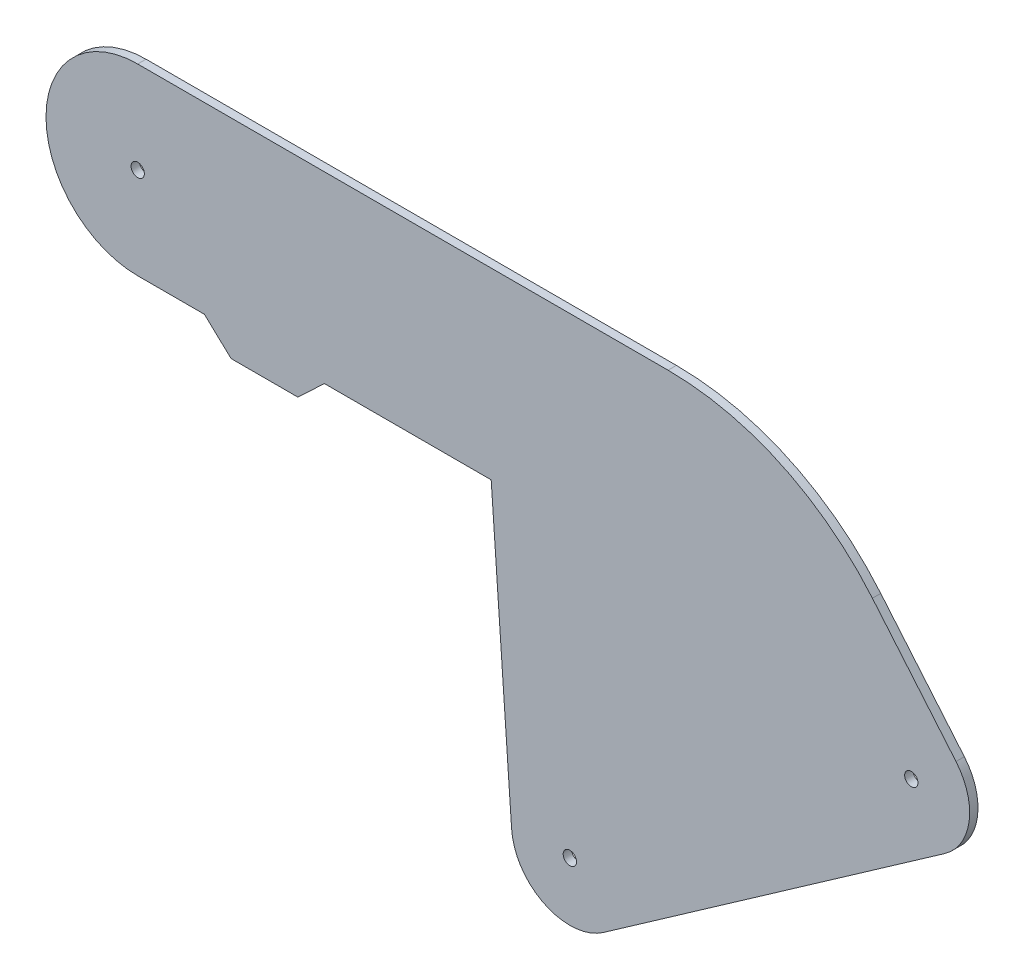
ISO-10303-21;
HEADER;
FILE_DESCRIPTION(('STEP AP214'),'2;1');
FILE_NAME('part.step','',(''),(''),'','','');
FILE_SCHEMA(('AUTOMOTIVE_DESIGN { 1 0 10303 214 1 1 1 1 }'));
ENDSEC;
DATA;
#1=APPLICATION_CONTEXT('core data for automotive mechanical design processes');
#2=APPLICATION_PROTOCOL_DEFINITION('international standard','automotive_design',2000,#1);
#3=PRODUCT_CONTEXT('',#1,'mechanical');
#4=PRODUCT('Part','Part','',(#3));
#5=PRODUCT_RELATED_PRODUCT_CATEGORY('part','',(#4));
#6=PRODUCT_DEFINITION_FORMATION('','',#4);
#7=PRODUCT_DEFINITION_CONTEXT('part definition',#1,'design');
#8=PRODUCT_DEFINITION('design','',#6,#7);
#9=PRODUCT_DEFINITION_SHAPE('','',#8);
#10=(LENGTH_UNIT() NAMED_UNIT(*) SI_UNIT(.MILLI.,.METRE.));
#11=(NAMED_UNIT(*) PLANE_ANGLE_UNIT() SI_UNIT($,.RADIAN.));
#12=(NAMED_UNIT(*) SI_UNIT($,.STERADIAN.) SOLID_ANGLE_UNIT());
#13=UNCERTAINTY_MEASURE_WITH_UNIT(LENGTH_MEASURE(1.E-05),#10,'distance_accuracy_value','');
#14=(GEOMETRIC_REPRESENTATION_CONTEXT(3) GLOBAL_UNCERTAINTY_ASSIGNED_CONTEXT((#13)) GLOBAL_UNIT_ASSIGNED_CONTEXT((#10,
#11,#12)) REPRESENTATION_CONTEXT('',''));
#15=CARTESIAN_POINT('',(0.,0.,0.));
#16=DIRECTION('',(0.,0.,1.));
#17=DIRECTION('',(1.,0.,0.));
#18=AXIS2_PLACEMENT_3D('',#15,#16,#17);
#19=CARTESIAN_POINT('',(164.572072720799,71.2488259804572,3.175));
#20=DIRECTION('',(0.,0.,1.));
#21=DIRECTION('',(1.,0.,0.));
#22=AXIS2_PLACEMENT_3D('',#19,#20,#21);
#23=PLANE('',#22);
#24=CARTESIAN_POINT('',(0.,215.9,3.175));
#25=DIRECTION('',(0.,0.,1.));
#26=DIRECTION('',(1.,0.,0.));
#27=AXIS2_PLACEMENT_3D('',#24,#25,#26);
#28=CIRCLE('',#27,2.54000000000001);
#29=CARTESIAN_POINT('',(2.54000000000001,215.9,3.175));
#30=VERTEX_POINT('',#29);
#31=EDGE_CURVE('E308',#30,#30,#28,.T.);
#32=ORIENTED_EDGE('',*,*,#31,.F.);
#33=EDGE_LOOP('',(#32));
#34=FACE_BOUND('',#33,.T.);
#35=CARTESIAN_POINT('',(164.572072720799,71.2488259804572,3.175));
#36=DIRECTION('',(0.,0.,1.));
#37=DIRECTION('',(1.,0.,0.));
#38=AXIS2_PLACEMENT_3D('',#35,#36,#37);
#39=CIRCLE('',#38,22.2249999999999);
#40=CARTESIAN_POINT('',(142.401211703775,69.6984883514941,3.175));
#41=VERTEX_POINT('',#40);
#42=CARTESIAN_POINT('',(177.319809018701,53.0431717961344,3.175));
#43=VERTEX_POINT('',#42);
#44=EDGE_CURVE('E194',#41,#43,#39,.T.);
#45=ORIENTED_EDGE('',*,*,#44,.T.);
#46=DIRECTION('',(0.819152044288991,0.573576436351047,0.));
#47=VECTOR('',#46,1.);
#48=CARTESIAN_POINT('',(177.319809018701,53.0431717961344,3.175));
#49=LINE('',#48,#47);
#50=CARTESIAN_POINT('',(307.360196049579,144.098431066863,3.175));
#51=VERTEX_POINT('',#50);
#52=EDGE_CURVE('E117',#43,#51,#49,.T.);
#53=ORIENTED_EDGE('',*,*,#52,.T.);
#54=CARTESIAN_POINT('',(294.612459751677,162.304085251186,3.175));
#55=DIRECTION('',(0.,0.,1.));
#56=DIRECTION('',(-1.,0.,0.));
#57=AXIS2_PLACEMENT_3D('',#54,#55,#56);
#58=CIRCLE('',#57,22.225);
#59=CARTESIAN_POINT('',(311.637797499996,176.590039876469,3.175));
#60=VERTEX_POINT('',#59);
#61=EDGE_CURVE('E224',#51,#60,#58,.T.);
#62=ORIENTED_EDGE('',*,*,#61,.T.);
#63=DIRECTION('',(-0.642787609686537,0.76604444311898,0.));
#64=VECTOR('',#63,1.);
#65=CARTESIAN_POINT('',(279.800527192222,214.532221144152,3.175));
#66=LINE('',#65,#64);
#67=CARTESIAN_POINT('',(279.800527192222,214.532221144152,3.175));
#68=VERTEX_POINT('',#67);
#69=EDGE_CURVE('E243',#60,#68,#66,.T.);
#70=ORIENTED_EDGE('',*,*,#69,.T.);
#71=CARTESIAN_POINT('',(201.970411771333,149.225,3.175));
#72=DIRECTION('',(0.,0.,1.));
#73=DIRECTION('',(-1.,0.,0.));
#74=AXIS2_PLACEMENT_3D('',#71,#72,#73);
#75=CIRCLE('',#74,101.6);
#76=CARTESIAN_POINT('',(201.970411771333,250.825,3.175));
#77=VERTEX_POINT('',#76);
#78=EDGE_CURVE('E240',#68,#77,#75,.T.);
#79=ORIENTED_EDGE('',*,*,#78,.T.);
#80=DIRECTION('',(-1.,0.,0.));
#81=VECTOR('',#80,1.);
#82=CARTESIAN_POINT('',(0.,250.825,3.175));
#83=LINE('',#82,#81);
#84=CARTESIAN_POINT('',(0.,250.825,3.175));
#85=VERTEX_POINT('',#84);
#86=EDGE_CURVE('E242',#77,#85,#83,.T.);
#87=ORIENTED_EDGE('',*,*,#86,.T.);
#88=CARTESIAN_POINT('',(0.,215.9,3.175));
#89=DIRECTION('',(0.,0.,1.));
#90=DIRECTION('',(1.,0.,0.));
#91=AXIS2_PLACEMENT_3D('',#88,#89,#90);
#92=CIRCLE('',#91,34.925);
#93=CARTESIAN_POINT('',(0.,180.975,3.175));
#94=VERTEX_POINT('',#93);
#95=EDGE_CURVE('E245',#85,#94,#92,.T.);
#96=ORIENTED_EDGE('',*,*,#95,.T.);
#97=DIRECTION('',(1.,0.,0.));
#98=VECTOR('',#97,1.);
#99=CARTESIAN_POINT('',(0.,180.975,3.175));
#100=LINE('',#99,#98);
#101=CARTESIAN_POINT('',(25.4,180.975,3.175));
#102=VERTEX_POINT('',#101);
#103=EDGE_CURVE('E251',#94,#102,#100,.T.);
#104=ORIENTED_EDGE('',*,*,#103,.T.);
#105=DIRECTION('',(0.729537204140084,-0.683941128881331,0.));
#106=VECTOR('',#105,1.);
#107=CARTESIAN_POINT('',(25.4,180.975,3.175));
#108=LINE('',#107,#106);
#109=CARTESIAN_POINT('',(35.56,171.45,3.175));
#110=VERTEX_POINT('',#109);
#111=EDGE_CURVE('E253',#102,#110,#108,.T.);
#112=ORIENTED_EDGE('',*,*,#111,.T.);
#113=DIRECTION('',(1.,0.,0.));
#114=VECTOR('',#113,1.);
#115=CARTESIAN_POINT('',(35.56,171.45,3.175));
#116=LINE('',#115,#114);
#117=CARTESIAN_POINT('',(60.96,171.45,3.175));
#118=VERTEX_POINT('',#117);
#119=EDGE_CURVE('E151',#110,#118,#116,.T.);
#120=ORIENTED_EDGE('',*,*,#119,.T.);
#121=DIRECTION('',(0.729537204140085,0.68394112888133,0.));
#122=VECTOR('',#121,1.);
#123=CARTESIAN_POINT('',(60.96,171.45,3.175));
#124=LINE('',#123,#122);
#125=CARTESIAN_POINT('',(71.12,180.975,3.175));
#126=VERTEX_POINT('',#125);
#127=EDGE_CURVE('E145',#118,#126,#124,.T.);
#128=ORIENTED_EDGE('',*,*,#127,.T.);
#129=DIRECTION('',(1.,0.,0.));
#130=VECTOR('',#129,1.);
#131=CARTESIAN_POINT('',(71.12,180.975,3.175));
#132=LINE('',#131,#130);
#133=CARTESIAN_POINT('',(134.62,180.975,3.175));
#134=VERTEX_POINT('',#133);
#135=EDGE_CURVE('E149',#126,#134,#132,.T.);
#136=ORIENTED_EDGE('',*,*,#135,.T.);
#137=DIRECTION('',(0.069756473744122,-0.997564050259824,0.));
#138=VECTOR('',#137,1.);
#139=CARTESIAN_POINT('',(134.62,180.975,3.175));
#140=LINE('',#139,#138);
#141=EDGE_CURVE('E59',#134,#41,#140,.T.);
#142=ORIENTED_EDGE('',*,*,#141,.T.);
#143=EDGE_LOOP('',(#45,#53,#62,#70,#79,#87,#96,#104,#112,#120,#128,#136,#142));
#144=FACE_BOUND('',#143,.T.);
#145=CARTESIAN_POINT('',(164.572072720799,71.2488259804572,3.175));
#146=DIRECTION('',(0.,0.,1.));
#147=DIRECTION('',(1.,0.,0.));
#148=AXIS2_PLACEMENT_3D('',#145,#146,#147);
#149=CIRCLE('',#148,2.5400000000398);
#150=CARTESIAN_POINT('',(167.112072720839,71.2488259804572,3.175));
#151=VERTEX_POINT('',#150);
#152=EDGE_CURVE('E173',#151,#151,#149,.T.);
#153=ORIENTED_EDGE('',*,*,#152,.F.);
#154=EDGE_LOOP('',(#153));
#155=FACE_BOUND('',#154,.T.);
#156=CARTESIAN_POINT('',(294.612459751677,162.304085251186,3.175));
#157=DIRECTION('',(0.,0.,1.));
#158=DIRECTION('',(1.,0.,0.));
#159=AXIS2_PLACEMENT_3D('',#156,#157,#158);
#160=CIRCLE('',#159,2.54000000000186);
#161=CARTESIAN_POINT('',(297.152459751678,162.304085251186,3.175));
#162=VERTEX_POINT('',#161);
#163=EDGE_CURVE('E299',#162,#162,#160,.T.);
#164=ORIENTED_EDGE('',*,*,#163,.F.);
#165=EDGE_LOOP('',(#164));
#166=FACE_BOUND('',#165,.T.);
#167=ADVANCED_FACE('F42',(#34,#144,#155,#166),#23,.T.);
#168=CARTESIAN_POINT('',(164.572072720799,71.2488259804572,0.));
#169=DIRECTION('',(0.,0.,1.));
#170=DIRECTION('',(1.,0.,0.));
#171=AXIS2_PLACEMENT_3D('',#168,#169,#170);
#172=PLANE('',#171);
#173=CARTESIAN_POINT('',(164.572072720799,71.2488259804572,0.));
#174=DIRECTION('',(0.,0.,1.));
#175=DIRECTION('',(1.,0.,0.));
#176=AXIS2_PLACEMENT_3D('',#173,#174,#175);
#177=CIRCLE('',#176,22.2249999999999);
#178=CARTESIAN_POINT('',(142.401211703775,69.6984883514941,0.));
#179=VERTEX_POINT('',#178);
#180=CARTESIAN_POINT('',(177.319809018701,53.0431717961344,0.));
#181=VERTEX_POINT('',#180);
#182=EDGE_CURVE('E169',#179,#181,#177,.T.);
#183=ORIENTED_EDGE('',*,*,#182,.F.);
#184=DIRECTION('',(0.069756473744122,-0.997564050259824,0.));
#185=VECTOR('',#184,1.);
#186=CARTESIAN_POINT('',(134.62,180.975,0.));
#187=LINE('',#186,#185);
#188=CARTESIAN_POINT('',(134.62,180.975,0.));
#189=VERTEX_POINT('',#188);
#190=EDGE_CURVE('E109',#189,#179,#187,.T.);
#191=ORIENTED_EDGE('',*,*,#190,.F.);
#192=DIRECTION('',(1.,0.,0.));
#193=VECTOR('',#192,1.);
#194=CARTESIAN_POINT('',(71.12,180.975,0.));
#195=LINE('',#194,#193);
#196=CARTESIAN_POINT('',(71.12,180.975,0.));
#197=VERTEX_POINT('',#196);
#198=EDGE_CURVE('E103',#197,#189,#195,.T.);
#199=ORIENTED_EDGE('',*,*,#198,.F.);
#200=DIRECTION('',(0.729537204140085,0.68394112888133,0.));
#201=VECTOR('',#200,1.);
#202=CARTESIAN_POINT('',(60.96,171.45,0.));
#203=LINE('',#202,#201);
#204=CARTESIAN_POINT('',(60.96,171.45,0.));
#205=VERTEX_POINT('',#204);
#206=EDGE_CURVE('E159',#205,#197,#203,.T.);
#207=ORIENTED_EDGE('',*,*,#206,.F.);
#208=DIRECTION('',(1.,0.,0.));
#209=VECTOR('',#208,1.);
#210=CARTESIAN_POINT('',(35.56,171.45,0.));
#211=LINE('',#210,#209);
#212=CARTESIAN_POINT('',(35.56,171.45,0.));
#213=VERTEX_POINT('',#212);
#214=EDGE_CURVE('E189',#213,#205,#211,.T.);
#215=ORIENTED_EDGE('',*,*,#214,.F.);
#216=DIRECTION('',(0.729537204140084,-0.683941128881331,0.));
#217=VECTOR('',#216,1.);
#218=CARTESIAN_POINT('',(25.4,180.975,0.));
#219=LINE('',#218,#217);
#220=CARTESIAN_POINT('',(25.4,180.975,0.));
#221=VERTEX_POINT('',#220);
#222=EDGE_CURVE('E187',#221,#213,#219,.T.);
#223=ORIENTED_EDGE('',*,*,#222,.F.);
#224=DIRECTION('',(1.,0.,0.));
#225=VECTOR('',#224,1.);
#226=CARTESIAN_POINT('',(0.,180.975,0.));
#227=LINE('',#226,#225);
#228=CARTESIAN_POINT('',(0.,180.975,0.));
#229=VERTEX_POINT('',#228);
#230=EDGE_CURVE('E185',#229,#221,#227,.T.);
#231=ORIENTED_EDGE('',*,*,#230,.F.);
#232=CARTESIAN_POINT('',(0.,215.9,0.));
#233=DIRECTION('',(0.,0.,1.));
#234=DIRECTION('',(1.,0.,0.));
#235=AXIS2_PLACEMENT_3D('',#232,#233,#234);
#236=CIRCLE('',#235,34.925);
#237=CARTESIAN_POINT('',(0.,250.825,0.));
#238=VERTEX_POINT('',#237);
#239=EDGE_CURVE('E183',#238,#229,#236,.T.);
#240=ORIENTED_EDGE('',*,*,#239,.F.);
#241=DIRECTION('',(-1.,0.,0.));
#242=VECTOR('',#241,1.);
#243=CARTESIAN_POINT('',(0.,250.825,0.));
#244=LINE('',#243,#242);
#245=CARTESIAN_POINT('',(201.970411771333,250.825,0.));
#246=VERTEX_POINT('',#245);
#247=EDGE_CURVE('E181',#246,#238,#244,.T.);
#248=ORIENTED_EDGE('',*,*,#247,.F.);
#249=CARTESIAN_POINT('',(201.970411771333,149.225,0.));
#250=DIRECTION('',(0.,0.,1.));
#251=DIRECTION('',(-1.,0.,0.));
#252=AXIS2_PLACEMENT_3D('',#249,#250,#251);
#253=CIRCLE('',#252,101.6);
#254=CARTESIAN_POINT('',(279.800527192222,214.532221144152,0.));
#255=VERTEX_POINT('',#254);
#256=EDGE_CURVE('E179',#255,#246,#253,.T.);
#257=ORIENTED_EDGE('',*,*,#256,.F.);
#258=DIRECTION('',(-0.642787609686537,0.76604444311898,0.));
#259=VECTOR('',#258,1.);
#260=CARTESIAN_POINT('',(279.800527192222,214.532221144152,0.));
#261=LINE('',#260,#259);
#262=CARTESIAN_POINT('',(311.637797499996,176.590039876469,0.));
#263=VERTEX_POINT('',#262);
#264=EDGE_CURVE('E177',#263,#255,#261,.T.);
#265=ORIENTED_EDGE('',*,*,#264,.F.);
#266=CARTESIAN_POINT('',(294.612459751677,162.304085251186,0.));
#267=DIRECTION('',(0.,0.,1.));
#268=DIRECTION('',(-1.,0.,0.));
#269=AXIS2_PLACEMENT_3D('',#266,#267,#268);
#270=CIRCLE('',#269,22.225);
#271=CARTESIAN_POINT('',(307.360196049579,144.098431066863,0.));
#272=VERTEX_POINT('',#271);
#273=EDGE_CURVE('E175',#272,#263,#270,.T.);
#274=ORIENTED_EDGE('',*,*,#273,.F.);
#275=DIRECTION('',(0.819152044288991,0.573576436351047,0.));
#276=VECTOR('',#275,1.);
#277=CARTESIAN_POINT('',(177.319809018701,53.0431717961344,0.));
#278=LINE('',#277,#276);
#279=EDGE_CURVE('E172',#181,#272,#278,.T.);
#280=ORIENTED_EDGE('',*,*,#279,.F.);
#281=EDGE_LOOP('',(#183,#191,#199,#207,#215,#223,#231,#240,#248,#257,#265,#274,#280));
#282=FACE_BOUND('',#281,.T.);
#283=CARTESIAN_POINT('',(164.572072720799,71.2488259804572,0.));
#284=DIRECTION('',(0.,0.,1.));
#285=DIRECTION('',(1.,0.,0.));
#286=AXIS2_PLACEMENT_3D('',#283,#284,#285);
#287=CIRCLE('',#286,2.5400000000398);
#288=CARTESIAN_POINT('',(167.112072720839,71.2488259804572,0.));
#289=VERTEX_POINT('',#288);
#290=EDGE_CURVE('E311',#289,#289,#287,.T.);
#291=ORIENTED_EDGE('',*,*,#290,.T.);
#292=EDGE_LOOP('',(#291));
#293=FACE_BOUND('',#292,.T.);
#294=CARTESIAN_POINT('',(0.,215.9,0.));
#295=DIRECTION('',(0.,0.,1.));
#296=DIRECTION('',(1.,0.,0.));
#297=AXIS2_PLACEMENT_3D('',#294,#295,#296);
#298=CIRCLE('',#297,2.54000000000001);
#299=CARTESIAN_POINT('',(2.54000000000001,215.9,0.));
#300=VERTEX_POINT('',#299);
#301=EDGE_CURVE('E305',#300,#300,#298,.T.);
#302=ORIENTED_EDGE('',*,*,#301,.T.);
#303=EDGE_LOOP('',(#302));
#304=FACE_BOUND('',#303,.T.);
#305=CARTESIAN_POINT('',(294.612459751677,162.304085251186,0.));
#306=DIRECTION('',(0.,0.,1.));
#307=DIRECTION('',(1.,0.,0.));
#308=AXIS2_PLACEMENT_3D('',#305,#306,#307);
#309=CIRCLE('',#308,2.54000000000186);
#310=CARTESIAN_POINT('',(297.152459751678,162.304085251186,0.));
#311=VERTEX_POINT('',#310);
#312=EDGE_CURVE('E302',#311,#311,#309,.T.);
#313=ORIENTED_EDGE('',*,*,#312,.T.);
#314=EDGE_LOOP('',(#313));
#315=FACE_BOUND('',#314,.T.);
#316=ADVANCED_FACE('F228',(#282,#293,#304,#315),#172,.F.);
#317=CARTESIAN_POINT('',(164.572072720799,71.2488259804572,3.175));
#318=DIRECTION('',(0.,0.,-1.));
#319=DIRECTION('',(-1.,0.,0.));
#320=AXIS2_PLACEMENT_3D('',#317,#318,#319);
#321=CYLINDRICAL_SURFACE('',#320,22.2249999999999);
#322=ORIENTED_EDGE('',*,*,#182,.T.);
#323=DIRECTION('',(0.,0.,-1.));
#324=VECTOR('',#323,1.);
#325=CARTESIAN_POINT('',(177.319809018701,53.0431717961344,3.175));
#326=LINE('',#325,#324);
#327=EDGE_CURVE('E11',#43,#181,#326,.T.);
#328=ORIENTED_EDGE('',*,*,#327,.F.);
#329=ORIENTED_EDGE('',*,*,#44,.F.);
#330=DIRECTION('',(0.,0.,-1.));
#331=VECTOR('',#330,1.);
#332=CARTESIAN_POINT('',(142.401211703775,69.6984883514941,3.175));
#333=LINE('',#332,#331);
#334=EDGE_CURVE('E165',#41,#179,#333,.T.);
#335=ORIENTED_EDGE('',*,*,#334,.T.);
#336=EDGE_LOOP('',(#322,#328,#329,#335));
#337=FACE_BOUND('',#336,.T.);
#338=ADVANCED_FACE('F44',(#337),#321,.T.);
#339=CARTESIAN_POINT('',(177.319809018701,53.0431717961344,3.175));
#340=DIRECTION('',(-0.573576436351047,0.819152044288991,0.));
#341=DIRECTION('',(-0.819152044288992,-0.573576436351047,0.));
#342=AXIS2_PLACEMENT_3D('',#339,#340,#341);
#343=PLANE('',#342);
#344=ORIENTED_EDGE('',*,*,#279,.T.);
#345=DIRECTION('',(0.,0.,-1.));
#346=VECTOR('',#345,1.);
#347=CARTESIAN_POINT('',(307.360196049579,144.098431066863,3.175));
#348=LINE('',#347,#346);
#349=EDGE_CURVE('E51',#51,#272,#348,.T.);
#350=ORIENTED_EDGE('',*,*,#349,.F.);
#351=ORIENTED_EDGE('',*,*,#52,.F.);
#352=ORIENTED_EDGE('',*,*,#327,.T.);
#353=EDGE_LOOP('',(#344,#350,#351,#352));
#354=FACE_BOUND('',#353,.T.);
#355=ADVANCED_FACE('F426',(#354),#343,.F.);
#356=CARTESIAN_POINT('',(294.612459751677,162.304085251186,3.175));
#357=DIRECTION('',(0.,0.,-1.));
#358=DIRECTION('',(-1.,0.,0.));
#359=AXIS2_PLACEMENT_3D('',#356,#357,#358);
#360=CYLINDRICAL_SURFACE('',#359,22.225);
#361=ORIENTED_EDGE('',*,*,#273,.T.);
#362=DIRECTION('',(0.,0.,-1.));
#363=VECTOR('',#362,1.);
#364=CARTESIAN_POINT('',(311.637797499996,176.590039876469,3.175));
#365=LINE('',#364,#363);
#366=EDGE_CURVE('E216',#60,#263,#365,.T.);
#367=ORIENTED_EDGE('',*,*,#366,.F.);
#368=ORIENTED_EDGE('',*,*,#61,.F.);
#369=ORIENTED_EDGE('',*,*,#349,.T.);
#370=EDGE_LOOP('',(#361,#367,#368,#369));
#371=FACE_BOUND('',#370,.T.);
#372=ADVANCED_FACE('F222',(#371),#360,.T.);
#373=CARTESIAN_POINT('',(279.800527192222,214.532221144152,3.175));
#374=DIRECTION('',(-0.76604444311898,-0.642787609686537,0.));
#375=DIRECTION('',(0.642787609686537,-0.76604444311898,0.));
#376=AXIS2_PLACEMENT_3D('',#373,#374,#375);
#377=PLANE('',#376);
#378=ORIENTED_EDGE('',*,*,#264,.T.);
#379=DIRECTION('',(0.,0.,-1.));
#380=VECTOR('',#379,1.);
#381=CARTESIAN_POINT('',(279.800527192222,214.532221144152,3.175));
#382=LINE('',#381,#380);
#383=EDGE_CURVE('E213',#68,#255,#382,.T.);
#384=ORIENTED_EDGE('',*,*,#383,.F.);
#385=ORIENTED_EDGE('',*,*,#69,.F.);
#386=ORIENTED_EDGE('',*,*,#366,.T.);
#387=EDGE_LOOP('',(#378,#384,#385,#386));
#388=FACE_BOUND('',#387,.T.);
#389=ADVANCED_FACE('F234',(#388),#377,.F.);
#390=CARTESIAN_POINT('',(201.970411771333,149.225,3.175));
#391=DIRECTION('',(0.,0.,-1.));
#392=DIRECTION('',(-1.,0.,0.));
#393=AXIS2_PLACEMENT_3D('',#390,#391,#392);
#394=CYLINDRICAL_SURFACE('',#393,101.6);
#395=ORIENTED_EDGE('',*,*,#256,.T.);
#396=DIRECTION('',(0.,0.,-1.));
#397=VECTOR('',#396,1.);
#398=CARTESIAN_POINT('',(201.970411771333,250.825,3.175));
#399=LINE('',#398,#397);
#400=EDGE_CURVE('E210',#77,#246,#399,.T.);
#401=ORIENTED_EDGE('',*,*,#400,.F.);
#402=ORIENTED_EDGE('',*,*,#78,.F.);
#403=ORIENTED_EDGE('',*,*,#383,.T.);
#404=EDGE_LOOP('',(#395,#401,#402,#403));
#405=FACE_BOUND('',#404,.T.);
#406=ADVANCED_FACE('F238',(#405),#394,.T.);
#407=CARTESIAN_POINT('',(0.,250.825,3.175));
#408=DIRECTION('',(0.,-1.,0.));
#409=DIRECTION('',(1.,0.,0.));
#410=AXIS2_PLACEMENT_3D('',#407,#408,#409);
#411=PLANE('',#410);
#412=ORIENTED_EDGE('',*,*,#247,.T.);
#413=DIRECTION('',(0.,0.,-1.));
#414=VECTOR('',#413,1.);
#415=CARTESIAN_POINT('',(0.,250.825,3.175));
#416=LINE('',#415,#414);
#417=EDGE_CURVE('E207',#85,#238,#416,.T.);
#418=ORIENTED_EDGE('',*,*,#417,.F.);
#419=ORIENTED_EDGE('',*,*,#86,.F.);
#420=ORIENTED_EDGE('',*,*,#400,.T.);
#421=EDGE_LOOP('',(#412,#418,#419,#420));
#422=FACE_BOUND('',#421,.T.);
#423=ADVANCED_FACE('F391',(#422),#411,.F.);
#424=CARTESIAN_POINT('',(0.,215.9,3.175));
#425=DIRECTION('',(0.,0.,-1.));
#426=DIRECTION('',(-1.,0.,0.));
#427=AXIS2_PLACEMENT_3D('',#424,#425,#426);
#428=CYLINDRICAL_SURFACE('',#427,34.925);
#429=ORIENTED_EDGE('',*,*,#239,.T.);
#430=DIRECTION('',(0.,0.,-1.));
#431=VECTOR('',#430,1.);
#432=CARTESIAN_POINT('',(0.,180.975,3.175));
#433=LINE('',#432,#431);
#434=EDGE_CURVE('E204',#94,#229,#433,.T.);
#435=ORIENTED_EDGE('',*,*,#434,.F.);
#436=ORIENTED_EDGE('',*,*,#95,.F.);
#437=ORIENTED_EDGE('',*,*,#417,.T.);
#438=EDGE_LOOP('',(#429,#435,#436,#437));
#439=FACE_BOUND('',#438,.T.);
#440=ADVANCED_FACE('F381',(#439),#428,.T.);
#441=CARTESIAN_POINT('',(0.,180.975,3.175));
#442=DIRECTION('',(0.,1.,0.));
#443=DIRECTION('',(0.,0.,1.));
#444=AXIS2_PLACEMENT_3D('',#441,#442,#443);
#445=PLANE('',#444);
#446=ORIENTED_EDGE('',*,*,#230,.T.);
#447=DIRECTION('',(0.,0.,-1.));
#448=VECTOR('',#447,1.);
#449=CARTESIAN_POINT('',(25.4,180.975,3.175));
#450=LINE('',#449,#448);
#451=EDGE_CURVE('E201',#102,#221,#450,.T.);
#452=ORIENTED_EDGE('',*,*,#451,.F.);
#453=ORIENTED_EDGE('',*,*,#103,.F.);
#454=ORIENTED_EDGE('',*,*,#434,.T.);
#455=EDGE_LOOP('',(#446,#452,#453,#454));
#456=FACE_BOUND('',#455,.T.);
#457=ADVANCED_FACE('F372',(#456),#445,.F.);
#458=CARTESIAN_POINT('',(25.4,180.975,3.175));
#459=DIRECTION('',(0.683941128881331,0.729537204140084,0.));
#460=DIRECTION('',(-0.729537204140084,0.683941128881331,0.));
#461=AXIS2_PLACEMENT_3D('',#458,#459,#460);
#462=PLANE('',#461);
#463=ORIENTED_EDGE('',*,*,#222,.T.);
#464=DIRECTION('',(0.,0.,-1.));
#465=VECTOR('',#464,1.);
#466=CARTESIAN_POINT('',(35.56,171.45,3.175));
#467=LINE('',#466,#465);
#468=EDGE_CURVE('E198',#110,#213,#467,.T.);
#469=ORIENTED_EDGE('',*,*,#468,.F.);
#470=ORIENTED_EDGE('',*,*,#111,.F.);
#471=ORIENTED_EDGE('',*,*,#451,.T.);
#472=EDGE_LOOP('',(#463,#469,#470,#471));
#473=FACE_BOUND('',#472,.T.);
#474=ADVANCED_FACE('F259',(#473),#462,.F.);
#475=CARTESIAN_POINT('',(35.56,171.45,3.175));
#476=DIRECTION('',(0.,1.,0.));
#477=DIRECTION('',(0.,0.,1.));
#478=AXIS2_PLACEMENT_3D('',#475,#476,#477);
#479=PLANE('',#478);
#480=ORIENTED_EDGE('',*,*,#214,.T.);
#481=DIRECTION('',(0.,0.,-1.));
#482=VECTOR('',#481,1.);
#483=CARTESIAN_POINT('',(60.96,171.45,3.175));
#484=LINE('',#483,#482);
#485=EDGE_CURVE('E160',#118,#205,#484,.T.);
#486=ORIENTED_EDGE('',*,*,#485,.F.);
#487=ORIENTED_EDGE('',*,*,#119,.F.);
#488=ORIENTED_EDGE('',*,*,#468,.T.);
#489=EDGE_LOOP('',(#480,#486,#487,#488));
#490=FACE_BOUND('',#489,.T.);
#491=ADVANCED_FACE('F263',(#490),#479,.F.);
#492=CARTESIAN_POINT('',(60.96,171.45,3.175));
#493=DIRECTION('',(-0.68394112888133,0.729537204140085,0.));
#494=DIRECTION('',(-0.729537204140085,-0.68394112888133,0.));
#495=AXIS2_PLACEMENT_3D('',#492,#493,#494);
#496=PLANE('',#495);
#497=ORIENTED_EDGE('',*,*,#206,.T.);
#498=DIRECTION('',(0.,0.,-1.));
#499=VECTOR('',#498,1.);
#500=CARTESIAN_POINT('',(71.12,180.975,3.175));
#501=LINE('',#500,#499);
#502=EDGE_CURVE('E156',#126,#197,#501,.T.);
#503=ORIENTED_EDGE('',*,*,#502,.F.);
#504=ORIENTED_EDGE('',*,*,#127,.F.);
#505=ORIENTED_EDGE('',*,*,#485,.T.);
#506=EDGE_LOOP('',(#497,#503,#504,#505));
#507=FACE_BOUND('',#506,.T.);
#508=ADVANCED_FACE('F157',(#507),#496,.F.);
#509=CARTESIAN_POINT('',(71.12,180.975,3.175));
#510=DIRECTION('',(0.,1.,0.));
#511=DIRECTION('',(-1.,0.,0.));
#512=AXIS2_PLACEMENT_3D('',#509,#510,#511);
#513=PLANE('',#512);
#514=ORIENTED_EDGE('',*,*,#198,.T.);
#515=DIRECTION('',(0.,0.,-1.));
#516=VECTOR('',#515,1.);
#517=CARTESIAN_POINT('',(134.62,180.975,3.175));
#518=LINE('',#517,#516);
#519=EDGE_CURVE('E161',#134,#189,#518,.T.);
#520=ORIENTED_EDGE('',*,*,#519,.F.);
#521=ORIENTED_EDGE('',*,*,#135,.F.);
#522=ORIENTED_EDGE('',*,*,#502,.T.);
#523=EDGE_LOOP('',(#514,#520,#521,#522));
#524=FACE_BOUND('',#523,.T.);
#525=ADVANCED_FACE('F163',(#524),#513,.F.);
#526=CARTESIAN_POINT('',(134.62,180.975,3.175));
#527=DIRECTION('',(0.997564050259824,0.069756473744122,0.));
#528=DIRECTION('',(-0.069756473744122,0.997564050259825,0.));
#529=AXIS2_PLACEMENT_3D('',#526,#527,#528);
#530=PLANE('',#529);
#531=ORIENTED_EDGE('',*,*,#190,.T.);
#532=ORIENTED_EDGE('',*,*,#334,.F.);
#533=ORIENTED_EDGE('',*,*,#141,.F.);
#534=ORIENTED_EDGE('',*,*,#519,.T.);
#535=EDGE_LOOP('',(#531,#532,#533,#534));
#536=FACE_BOUND('',#535,.T.);
#537=ADVANCED_FACE('F267',(#536),#530,.F.);
#538=CARTESIAN_POINT('',(164.572072720799,71.2488259804572,3.175));
#539=DIRECTION('',(0.,0.,-1.));
#540=DIRECTION('',(-1.,0.,0.));
#541=AXIS2_PLACEMENT_3D('',#538,#539,#540);
#542=CYLINDRICAL_SURFACE('',#541,2.5400000000398);
#543=ORIENTED_EDGE('',*,*,#152,.T.);
#544=EDGE_LOOP('',(#543));
#545=FACE_BOUND('',#544,.T.);
#546=ORIENTED_EDGE('',*,*,#290,.F.);
#547=EDGE_LOOP('',(#546));
#548=FACE_BOUND('',#547,.T.);
#549=ADVANCED_FACE('F269',(#545,#548),#542,.F.);
#550=CARTESIAN_POINT('',(0.,215.9,3.175));
#551=DIRECTION('',(0.,0.,-1.));
#552=DIRECTION('',(-1.,0.,0.));
#553=AXIS2_PLACEMENT_3D('',#550,#551,#552);
#554=CYLINDRICAL_SURFACE('',#553,2.54000000000001);
#555=ORIENTED_EDGE('',*,*,#31,.T.);
#556=EDGE_LOOP('',(#555));
#557=FACE_BOUND('',#556,.T.);
#558=ORIENTED_EDGE('',*,*,#301,.F.);
#559=EDGE_LOOP('',(#558));
#560=FACE_BOUND('',#559,.T.);
#561=ADVANCED_FACE('F275',(#557,#560),#554,.F.);
#562=CARTESIAN_POINT('',(294.612459751677,162.304085251186,3.175));
#563=DIRECTION('',(0.,0.,-1.));
#564=DIRECTION('',(-1.,0.,0.));
#565=AXIS2_PLACEMENT_3D('',#562,#563,#564);
#566=CYLINDRICAL_SURFACE('',#565,2.54000000000186);
#567=ORIENTED_EDGE('',*,*,#163,.T.);
#568=EDGE_LOOP('',(#567));
#569=FACE_BOUND('',#568,.T.);
#570=ORIENTED_EDGE('',*,*,#312,.F.);
#571=EDGE_LOOP('',(#570));
#572=FACE_BOUND('',#571,.T.);
#573=ADVANCED_FACE('F290',(#569,#572),#566,.F.);
#574=CLOSED_SHELL('',(#167,#316,#338,#355,#372,#389,#406,#423,#440,#457,#474,#491,#508,#525,
#537,#549,#561,#573));
#575=MANIFOLD_SOLID_BREP('B2',#574);
#576=ADVANCED_BREP_SHAPE_REPRESENTATION('',(#18,#575),#14);
#577=SHAPE_DEFINITION_REPRESENTATION(#9,#576);
ENDSEC;
END-ISO-10303-21;
